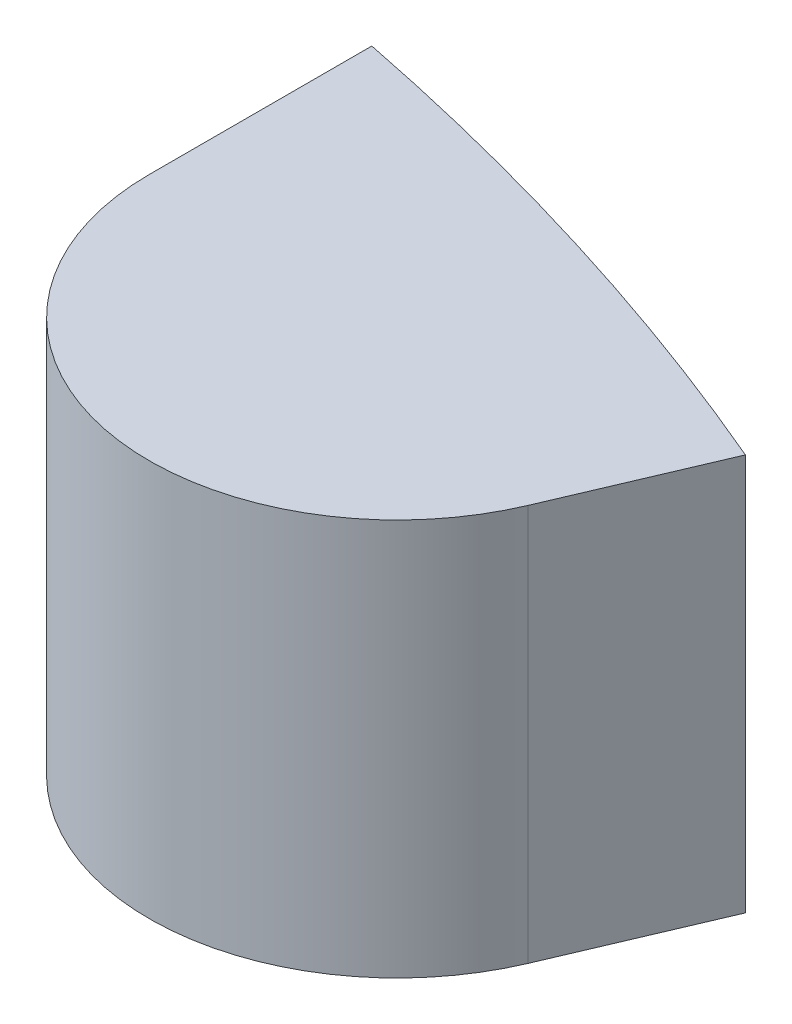
ISO-10303-21;
HEADER;
FILE_DESCRIPTION(('STEP AP214'),'2;1');
FILE_NAME('part.step','',(''),(''),'','','');
FILE_SCHEMA(('AUTOMOTIVE_DESIGN { 1 0 10303 214 1 1 1 1 }'));
ENDSEC;
DATA;
#1=APPLICATION_CONTEXT('core data for automotive mechanical design processes');
#2=APPLICATION_PROTOCOL_DEFINITION('international standard','automotive_design',2000,#1);
#3=PRODUCT_CONTEXT('',#1,'mechanical');
#4=PRODUCT('Part','Part','',(#3));
#5=PRODUCT_RELATED_PRODUCT_CATEGORY('part','',(#4));
#6=PRODUCT_DEFINITION_FORMATION('','',#4);
#7=PRODUCT_DEFINITION_CONTEXT('part definition',#1,'design');
#8=PRODUCT_DEFINITION('design','',#6,#7);
#9=PRODUCT_DEFINITION_SHAPE('','',#8);
#10=(LENGTH_UNIT() NAMED_UNIT(*) SI_UNIT(.MILLI.,.METRE.));
#11=(NAMED_UNIT(*) PLANE_ANGLE_UNIT() SI_UNIT($,.RADIAN.));
#12=(NAMED_UNIT(*) SI_UNIT($,.STERADIAN.) SOLID_ANGLE_UNIT());
#13=UNCERTAINTY_MEASURE_WITH_UNIT(LENGTH_MEASURE(1.E-05),#10,'distance_accuracy_value','');
#14=(GEOMETRIC_REPRESENTATION_CONTEXT(3) GLOBAL_UNCERTAINTY_ASSIGNED_CONTEXT((#13)) GLOBAL_UNIT_ASSIGNED_CONTEXT((#10,
#11,#12)) REPRESENTATION_CONTEXT('',''));
#15=CARTESIAN_POINT('',(0.,0.,0.));
#16=DIRECTION('',(0.,0.,1.));
#17=DIRECTION('',(1.,0.,0.));
#18=AXIS2_PLACEMENT_3D('',#15,#16,#17);
#19=CARTESIAN_POINT('',(0.,3.468427124746,0.));
#20=DIRECTION('',(0.,-1.,0.));
#21=DIRECTION('',(0.,0.,-1.));
#22=AXIS2_PLACEMENT_3D('',#19,#20,#21);
#23=CYLINDRICAL_SURFACE('',#22,4.445);
#24=CARTESIAN_POINT('',(0.,0.,0.));
#25=DIRECTION('',(0.,-1.,0.));
#26=DIRECTION('',(0.,0.,-1.));
#27=AXIS2_PLACEMENT_3D('',#24,#25,#26);
#28=CIRCLE('',#27,4.445);
#29=CARTESIAN_POINT('',(1.74273378550995,0.,-4.08912019300506));
#30=VERTEX_POINT('',#29);
#31=CARTESIAN_POINT('',(0.87,0.,-4.3590279879809));
#32=VERTEX_POINT('',#31);
#33=EDGE_CURVE('E74',#30,#32,#28,.F.);
#34=ORIENTED_EDGE('',*,*,#33,.T.);
#35=DIRECTION('',(0.,1.,0.));
#36=VECTOR('',#35,1.);
#37=CARTESIAN_POINT('',(0.87,3.468427124746,-4.359027987981));
#38=LINE('',#37,#36);
#39=CARTESIAN_POINT('',(0.87,0.64,-4.3590279879809));
#40=VERTEX_POINT('',#39);
#41=EDGE_CURVE('E60',#32,#40,#38,.T.);
#42=ORIENTED_EDGE('',*,*,#41,.T.);
#43=CARTESIAN_POINT('',(0.,0.64,0.));
#44=DIRECTION('',(0.,-1.,0.));
#45=DIRECTION('',(0.,0.,-1.));
#46=AXIS2_PLACEMENT_3D('',#43,#44,#45);
#47=CIRCLE('',#46,4.445);
#48=CARTESIAN_POINT('',(1.74273378550995,0.639999999999999,-4.08912019300506));
#49=VERTEX_POINT('',#48);
#50=EDGE_CURVE('E20',#49,#40,#47,.F.);
#51=ORIENTED_EDGE('',*,*,#50,.F.);
#52=DIRECTION('',(0.,1.,0.));
#53=VECTOR('',#52,1.);
#54=CARTESIAN_POINT('',(1.74273378550994,3.468427124746,-4.08912019300503));
#55=LINE('',#54,#53);
#56=EDGE_CURVE('E58',#49,#30,#55,.F.);
#57=ORIENTED_EDGE('',*,*,#56,.T.);
#58=EDGE_LOOP('',(#34,#42,#51,#57));
#59=FACE_BOUND('',#58,.T.);
#60=ADVANCED_FACE('F17',(#59),#23,.T.);
#61=CARTESIAN_POINT('',(0.,0.64,0.));
#62=DIRECTION('',(0.,1.,0.));
#63=DIRECTION('',(0.,0.,1.));
#64=AXIS2_PLACEMENT_3D('',#61,#62,#63);
#65=PLANE('',#64);
#66=DIRECTION('',(-0.391874443094984,0.,0.920018706792963));
#67=VECTOR('',#66,1.);
#68=CARTESIAN_POINT('',(1.638007482717,0.639999999999999,-3.843250222762));
#69=LINE('',#68,#67);
#70=CARTESIAN_POINT('',(1.63800748271709,0.64,-3.843250222762));
#71=VERTEX_POINT('',#70);
#72=EDGE_CURVE('E64',#71,#49,#69,.F.);
#73=ORIENTED_EDGE('',*,*,#72,.T.);
#74=ORIENTED_EDGE('',*,*,#50,.T.);
#75=DIRECTION('',(0.,0.,-1.));
#76=VECTOR('',#75,1.);
#77=CARTESIAN_POINT('',(0.87,0.64,-4.));
#78=LINE('',#77,#76);
#79=CARTESIAN_POINT('',(0.87,0.64,-4.));
#80=VERTEX_POINT('',#79);
#81=EDGE_CURVE('E79',#40,#80,#78,.F.);
#82=ORIENTED_EDGE('',*,*,#81,.T.);
#83=CARTESIAN_POINT('',(1.27,0.64,-4.));
#84=DIRECTION('',(0.,-1.,0.));
#85=DIRECTION('',(0.,0.,-1.));
#86=AXIS2_PLACEMENT_3D('',#83,#84,#85);
#87=CIRCLE('',#86,0.4);
#88=EDGE_CURVE('E67',#71,#80,#87,.T.);
#89=ORIENTED_EDGE('',*,*,#88,.F.);
#90=EDGE_LOOP('',(#73,#74,#82,#89));
#91=FACE_BOUND('',#90,.T.);
#92=ADVANCED_FACE('F65',(#91),#65,.T.);
#93=CARTESIAN_POINT('',(0.87,3.468427124746,-4.));
#94=DIRECTION('',(1.,0.,0.));
#95=DIRECTION('',(0.,0.,-1.));
#96=AXIS2_PLACEMENT_3D('',#93,#94,#95);
#97=PLANE('',#96);
#98=ORIENTED_EDGE('',*,*,#41,.F.);
#99=DIRECTION('',(0.,0.,1.));
#100=VECTOR('',#99,1.);
#101=CARTESIAN_POINT('',(0.87,0.,-4.));
#102=LINE('',#101,#100);
#103=CARTESIAN_POINT('',(0.87,0.,-4.));
#104=VERTEX_POINT('',#103);
#105=EDGE_CURVE('E71',#32,#104,#102,.T.);
#106=ORIENTED_EDGE('',*,*,#105,.T.);
#107=DIRECTION('',(0.,-1.,0.));
#108=VECTOR('',#107,1.);
#109=CARTESIAN_POINT('',(0.87,3.468427124746,-4.));
#110=LINE('',#109,#108);
#111=EDGE_CURVE('E82',#80,#104,#110,.T.);
#112=ORIENTED_EDGE('',*,*,#111,.F.);
#113=ORIENTED_EDGE('',*,*,#81,.F.);
#114=EDGE_LOOP('',(#98,#106,#112,#113));
#115=FACE_BOUND('',#114,.T.);
#116=ADVANCED_FACE('F89',(#115),#97,.F.);
#117=CARTESIAN_POINT('',(1.27,0.,-4.));
#118=DIRECTION('',(0.,1.,0.));
#119=DIRECTION('',(0.,0.,1.));
#120=AXIS2_PLACEMENT_3D('',#117,#118,#119);
#121=PLANE('',#120);
#122=ORIENTED_EDGE('',*,*,#105,.F.);
#123=ORIENTED_EDGE('',*,*,#33,.F.);
#124=DIRECTION('',(-0.391874443094984,0.,0.920018706792963));
#125=VECTOR('',#124,1.);
#126=CARTESIAN_POINT('',(1.638007482717,0.,-3.843250222762));
#127=LINE('',#126,#125);
#128=CARTESIAN_POINT('',(1.63800748271709,0.,-3.843250222762));
#129=VERTEX_POINT('',#128);
#130=EDGE_CURVE('E35',#30,#129,#127,.T.);
#131=ORIENTED_EDGE('',*,*,#130,.T.);
#132=CARTESIAN_POINT('',(1.27,0.,-4.));
#133=DIRECTION('',(0.,-1.,0.));
#134=DIRECTION('',(0.,0.,-1.));
#135=AXIS2_PLACEMENT_3D('',#132,#133,#134);
#136=CIRCLE('',#135,0.4);
#137=EDGE_CURVE('E26',#104,#129,#136,.F.);
#138=ORIENTED_EDGE('',*,*,#137,.F.);
#139=EDGE_LOOP('',(#122,#123,#131,#138));
#140=FACE_BOUND('',#139,.T.);
#141=ADVANCED_FACE('F91',(#140),#121,.F.);
#142=CARTESIAN_POINT('',(1.638007482717,3.468427124746,-3.843250222762));
#143=DIRECTION('',(-0.920018706792963,0.,-0.391874443094984));
#144=DIRECTION('',(-0.391874443094984,0.,0.920018706792963));
#145=AXIS2_PLACEMENT_3D('',#142,#143,#144);
#146=PLANE('',#145);
#147=DIRECTION('',(0.,-1.,0.));
#148=VECTOR('',#147,1.);
#149=CARTESIAN_POINT('',(1.63800748271715,3.468427124746,-3.84325022276193));
#150=LINE('',#149,#148);
#151=EDGE_CURVE('E11',#129,#71,#150,.F.);
#152=ORIENTED_EDGE('',*,*,#151,.F.);
#153=ORIENTED_EDGE('',*,*,#130,.F.);
#154=ORIENTED_EDGE('',*,*,#56,.F.);
#155=ORIENTED_EDGE('',*,*,#72,.F.);
#156=EDGE_LOOP('',(#152,#153,#154,#155));
#157=FACE_BOUND('',#156,.T.);
#158=ADVANCED_FACE('F70',(#157),#146,.F.);
#159=CARTESIAN_POINT('',(1.27,3.468427124746,-4.));
#160=DIRECTION('',(0.,-1.,0.));
#161=DIRECTION('',(0.,0.,-1.));
#162=AXIS2_PLACEMENT_3D('',#159,#160,#161);
#163=CYLINDRICAL_SURFACE('',#162,0.4);
#164=ORIENTED_EDGE('',*,*,#137,.T.);
#165=ORIENTED_EDGE('',*,*,#151,.T.);
#166=ORIENTED_EDGE('',*,*,#88,.T.);
#167=ORIENTED_EDGE('',*,*,#111,.T.);
#168=EDGE_LOOP('',(#164,#165,#166,#167));
#169=FACE_BOUND('',#168,.T.);
#170=ADVANCED_FACE('F87',(#169),#163,.T.);
#171=CLOSED_SHELL('',(#60,#92,#116,#141,#158,#170));
#172=MANIFOLD_SOLID_BREP('B1',#171);
#173=ADVANCED_BREP_SHAPE_REPRESENTATION('',(#18,#172),#14);
#174=SHAPE_DEFINITION_REPRESENTATION(#9,#173);
ENDSEC;
END-ISO-10303-21;
